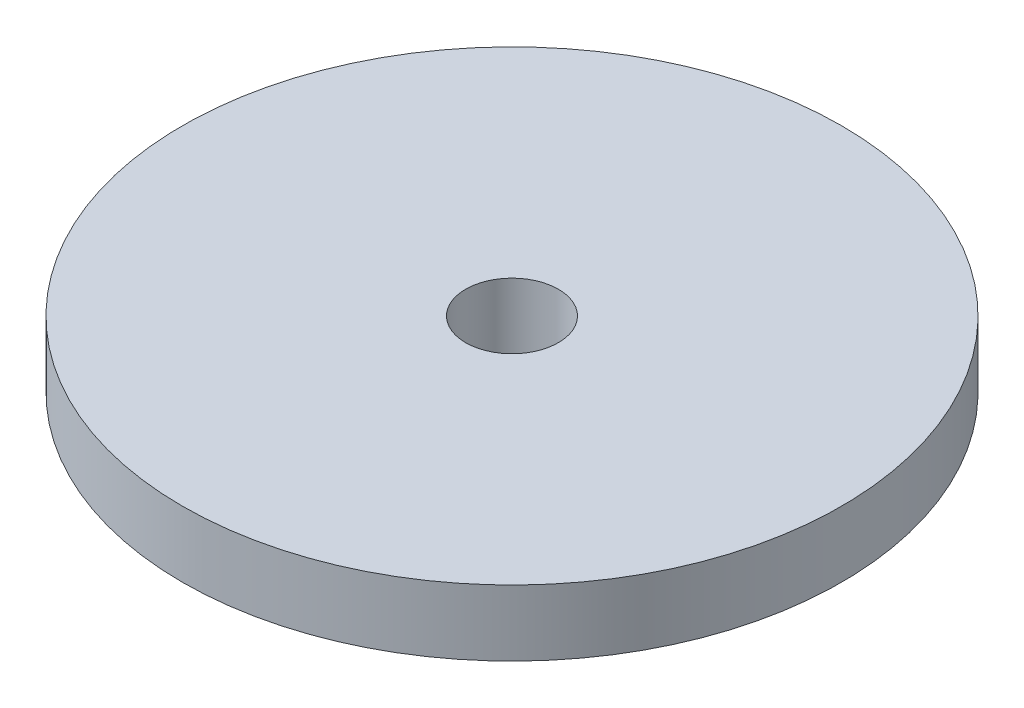
ISO-10303-21;
HEADER;
FILE_DESCRIPTION(('STEP AP214'),'2;1');
FILE_NAME('part.step','',(''),(''),'','','');
FILE_SCHEMA(('AUTOMOTIVE_DESIGN { 1 0 10303 214 1 1 1 1 }'));
ENDSEC;
DATA;
#1=APPLICATION_CONTEXT('core data for automotive mechanical design processes');
#2=APPLICATION_PROTOCOL_DEFINITION('international standard','automotive_design',2000,#1);
#3=PRODUCT_CONTEXT('',#1,'mechanical');
#4=PRODUCT('Part','Part','',(#3));
#5=PRODUCT_RELATED_PRODUCT_CATEGORY('part','',(#4));
#6=PRODUCT_DEFINITION_FORMATION('','',#4);
#7=PRODUCT_DEFINITION_CONTEXT('part definition',#1,'design');
#8=PRODUCT_DEFINITION('design','',#6,#7);
#9=PRODUCT_DEFINITION_SHAPE('','',#8);
#10=(LENGTH_UNIT() NAMED_UNIT(*) SI_UNIT(.MILLI.,.METRE.));
#11=(NAMED_UNIT(*) PLANE_ANGLE_UNIT() SI_UNIT($,.RADIAN.));
#12=(NAMED_UNIT(*) SI_UNIT($,.STERADIAN.) SOLID_ANGLE_UNIT());
#13=UNCERTAINTY_MEASURE_WITH_UNIT(LENGTH_MEASURE(1.E-05),#10,'distance_accuracy_value','');
#14=(GEOMETRIC_REPRESENTATION_CONTEXT(3) GLOBAL_UNCERTAINTY_ASSIGNED_CONTEXT((#13)) GLOBAL_UNIT_ASSIGNED_CONTEXT((#10,
#11,#12)) REPRESENTATION_CONTEXT('',''));
#15=CARTESIAN_POINT('',(0.,0.,0.));
#16=DIRECTION('',(0.,0.,1.));
#17=DIRECTION('',(1.,0.,0.));
#18=AXIS2_PLACEMENT_3D('',#15,#16,#17);
#19=CARTESIAN_POINT('',(0.,2.54,0.));
#20=DIRECTION('',(0.,1.,0.));
#21=DIRECTION('',(0.,0.,1.));
#22=AXIS2_PLACEMENT_3D('',#19,#20,#21);
#23=PLANE('',#22);
#24=CARTESIAN_POINT('',(0.,2.54,0.));
#25=DIRECTION('',(0.,1.,0.));
#26=DIRECTION('',(0.,0.,1.));
#27=AXIS2_PLACEMENT_3D('',#24,#25,#26);
#28=CIRCLE('',#27,12.7);
#29=CARTESIAN_POINT('',(0.,2.54,12.7));
#30=VERTEX_POINT('',#29);
#31=EDGE_CURVE('E10',#30,#30,#28,.T.);
#32=ORIENTED_EDGE('',*,*,#31,.T.);
#33=EDGE_LOOP('',(#32));
#34=FACE_BOUND('',#33,.T.);
#35=CARTESIAN_POINT('',(0.,2.54,0.));
#36=DIRECTION('',(0.,1.,0.));
#37=DIRECTION('',(0.,0.,1.));
#38=AXIS2_PLACEMENT_3D('',#35,#36,#37);
#39=CIRCLE('',#38,1.7859375);
#40=CARTESIAN_POINT('',(0.,2.54,1.7859375));
#41=VERTEX_POINT('',#40);
#42=EDGE_CURVE('E41',#41,#41,#39,.T.);
#43=ORIENTED_EDGE('',*,*,#42,.F.);
#44=EDGE_LOOP('',(#43));
#45=FACE_BOUND('',#44,.T.);
#46=ADVANCED_FACE('F30',(#34,#45),#23,.T.);
#47=CARTESIAN_POINT('',(0.,0.,0.));
#48=DIRECTION('',(0.,1.,0.));
#49=DIRECTION('',(0.,0.,1.));
#50=AXIS2_PLACEMENT_3D('',#47,#48,#49);
#51=PLANE('',#50);
#52=CARTESIAN_POINT('',(0.,0.,0.));
#53=DIRECTION('',(0.,1.,0.));
#54=DIRECTION('',(0.,0.,1.));
#55=AXIS2_PLACEMENT_3D('',#52,#53,#54);
#56=CIRCLE('',#55,12.7);
#57=CARTESIAN_POINT('',(0.,0.,12.7));
#58=VERTEX_POINT('',#57);
#59=EDGE_CURVE('E34',#58,#58,#56,.T.);
#60=ORIENTED_EDGE('',*,*,#59,.F.);
#61=EDGE_LOOP('',(#60));
#62=FACE_BOUND('',#61,.T.);
#63=CARTESIAN_POINT('',(0.,0.,0.));
#64=DIRECTION('',(0.,1.,0.));
#65=DIRECTION('',(0.,0.,1.));
#66=AXIS2_PLACEMENT_3D('',#63,#64,#65);
#67=CIRCLE('',#66,1.7859375);
#68=CARTESIAN_POINT('',(0.,0.,1.7859375));
#69=VERTEX_POINT('',#68);
#70=EDGE_CURVE('E43',#69,#69,#67,.T.);
#71=ORIENTED_EDGE('',*,*,#70,.T.);
#72=EDGE_LOOP('',(#71));
#73=FACE_BOUND('',#72,.T.);
#74=ADVANCED_FACE('F53',(#62,#73),#51,.F.);
#75=CARTESIAN_POINT('',(0.,2.54,0.));
#76=DIRECTION('',(0.,-1.,0.));
#77=DIRECTION('',(0.,0.,-1.));
#78=AXIS2_PLACEMENT_3D('',#75,#76,#77);
#79=CYLINDRICAL_SURFACE('',#78,12.7);
#80=ORIENTED_EDGE('',*,*,#31,.F.);
#81=EDGE_LOOP('',(#80));
#82=FACE_BOUND('',#81,.T.);
#83=ORIENTED_EDGE('',*,*,#59,.T.);
#84=EDGE_LOOP('',(#83));
#85=FACE_BOUND('',#84,.T.);
#86=ADVANCED_FACE('F32',(#82,#85),#79,.T.);
#87=CARTESIAN_POINT('',(0.,2.54,0.));
#88=DIRECTION('',(0.,-1.,0.));
#89=DIRECTION('',(0.,0.,-1.));
#90=AXIS2_PLACEMENT_3D('',#87,#88,#89);
#91=CYLINDRICAL_SURFACE('',#90,1.7859375);
#92=ORIENTED_EDGE('',*,*,#42,.T.);
#93=EDGE_LOOP('',(#92));
#94=FACE_BOUND('',#93,.T.);
#95=ORIENTED_EDGE('',*,*,#70,.F.);
#96=EDGE_LOOP('',(#95));
#97=FACE_BOUND('',#96,.T.);
#98=ADVANCED_FACE('F49',(#94,#97),#91,.F.);
#99=CLOSED_SHELL('',(#46,#74,#86,#98));
#100=MANIFOLD_SOLID_BREP('B2',#99);
#101=ADVANCED_BREP_SHAPE_REPRESENTATION('',(#18,#100),#14);
#102=SHAPE_DEFINITION_REPRESENTATION(#9,#101);
ENDSEC;
END-ISO-10303-21;
